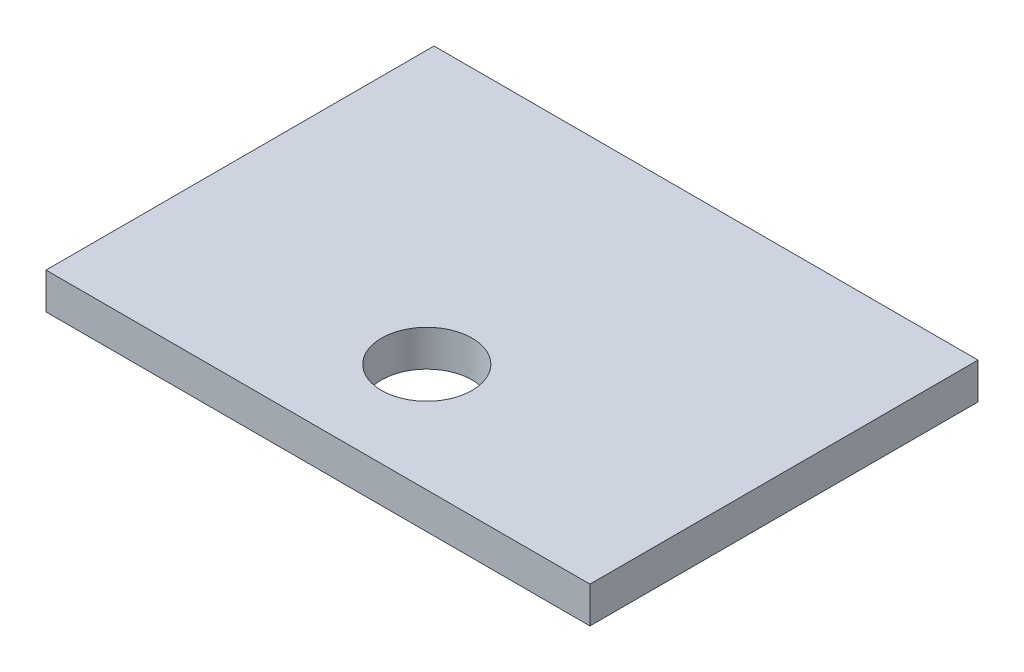
ISO-10303-21;
HEADER;
FILE_DESCRIPTION(('STEP AP214'),'2;1');
FILE_NAME('part.step','',(''),(''),'','','');
FILE_SCHEMA(('AUTOMOTIVE_DESIGN { 1 0 10303 214 1 1 1 1 }'));
ENDSEC;
DATA;
#1=APPLICATION_CONTEXT('core data for automotive mechanical design processes');
#2=APPLICATION_PROTOCOL_DEFINITION('international standard','automotive_design',2000,#1);
#3=PRODUCT_CONTEXT('',#1,'mechanical');
#4=PRODUCT('Part','Part','',(#3));
#5=PRODUCT_RELATED_PRODUCT_CATEGORY('part','',(#4));
#6=PRODUCT_DEFINITION_FORMATION('','',#4);
#7=PRODUCT_DEFINITION_CONTEXT('part definition',#1,'design');
#8=PRODUCT_DEFINITION('design','',#6,#7);
#9=PRODUCT_DEFINITION_SHAPE('','',#8);
#10=(LENGTH_UNIT() NAMED_UNIT(*) SI_UNIT(.MILLI.,.METRE.));
#11=(NAMED_UNIT(*) PLANE_ANGLE_UNIT() SI_UNIT($,.RADIAN.));
#12=(NAMED_UNIT(*) SI_UNIT($,.STERADIAN.) SOLID_ANGLE_UNIT());
#13=UNCERTAINTY_MEASURE_WITH_UNIT(LENGTH_MEASURE(1.E-05),#10,'distance_accuracy_value','');
#14=(GEOMETRIC_REPRESENTATION_CONTEXT(3) GLOBAL_UNCERTAINTY_ASSIGNED_CONTEXT((#13)) GLOBAL_UNIT_ASSIGNED_CONTEXT((#10,
#11,#12)) REPRESENTATION_CONTEXT('',''));
#15=CARTESIAN_POINT('',(0.,0.,0.));
#16=DIRECTION('',(0.,0.,1.));
#17=DIRECTION('',(1.,0.,0.));
#18=AXIS2_PLACEMENT_3D('',#15,#16,#17);
#19=CARTESIAN_POINT('',(0.,1.,0.));
#20=DIRECTION('',(0.,1.,0.));
#21=DIRECTION('',(0.,0.,1.));
#22=AXIS2_PLACEMENT_3D('',#19,#20,#21);
#23=PLANE('',#22);
#24=DIRECTION('',(0.,0.,-1.));
#25=VECTOR('',#24,1.);
#26=CARTESIAN_POINT('',(7.5,1.,-5.35));
#27=LINE('',#26,#25);
#28=CARTESIAN_POINT('',(7.5,1.,5.35));
#29=VERTEX_POINT('',#28);
#30=CARTESIAN_POINT('',(7.5,1.,-5.35));
#31=VERTEX_POINT('',#30);
#32=EDGE_CURVE('E89',#29,#31,#27,.T.);
#33=ORIENTED_EDGE('',*,*,#32,.T.);
#34=DIRECTION('',(-1.,0.,0.));
#35=VECTOR('',#34,1.);
#36=CARTESIAN_POINT('',(-7.5,1.,-5.35));
#37=LINE('',#36,#35);
#38=CARTESIAN_POINT('',(-7.5,1.,-5.35));
#39=VERTEX_POINT('',#38);
#40=EDGE_CURVE('E84',#31,#39,#37,.T.);
#41=ORIENTED_EDGE('',*,*,#40,.T.);
#42=DIRECTION('',(0.,0.,1.));
#43=VECTOR('',#42,1.);
#44=CARTESIAN_POINT('',(-7.5,1.,-5.35));
#45=LINE('',#44,#43);
#46=CARTESIAN_POINT('',(-7.5,1.,5.35));
#47=VERTEX_POINT('',#46);
#48=EDGE_CURVE('E87',#39,#47,#45,.T.);
#49=ORIENTED_EDGE('',*,*,#48,.T.);
#50=DIRECTION('',(1.,0.,0.));
#51=VECTOR('',#50,1.);
#52=CARTESIAN_POINT('',(-7.5,1.,5.35));
#53=LINE('',#52,#51);
#54=EDGE_CURVE('E54',#47,#29,#53,.T.);
#55=ORIENTED_EDGE('',*,*,#54,.T.);
#56=EDGE_LOOP('',(#33,#41,#49,#55));
#57=FACE_BOUND('',#56,.T.);
#58=CARTESIAN_POINT('',(0.,1.,2.35));
#59=DIRECTION('',(0.,1.,0.));
#60=DIRECTION('',(0.,0.,1.));
#61=AXIS2_PLACEMENT_3D('',#58,#59,#60);
#62=CIRCLE('',#61,1.25);
#63=CARTESIAN_POINT('',(0.,1.,3.6));
#64=VERTEX_POINT('',#63);
#65=EDGE_CURVE('E104',#64,#64,#62,.T.);
#66=ORIENTED_EDGE('',*,*,#65,.F.);
#67=EDGE_LOOP('',(#66));
#68=FACE_BOUND('',#67,.T.);
#69=ADVANCED_FACE('F37',(#57,#68),#23,.T.);
#70=CARTESIAN_POINT('',(0.,0.,0.));
#71=DIRECTION('',(0.,1.,0.));
#72=DIRECTION('',(0.,0.,1.));
#73=AXIS2_PLACEMENT_3D('',#70,#71,#72);
#74=PLANE('',#73);
#75=DIRECTION('',(0.,0.,-1.));
#76=VECTOR('',#75,1.);
#77=CARTESIAN_POINT('',(7.5,0.,-5.35));
#78=LINE('',#77,#76);
#79=CARTESIAN_POINT('',(7.5,0.,5.35));
#80=VERTEX_POINT('',#79);
#81=CARTESIAN_POINT('',(7.5,0.,-5.35));
#82=VERTEX_POINT('',#81);
#83=EDGE_CURVE('E101',#80,#82,#78,.T.);
#84=ORIENTED_EDGE('',*,*,#83,.F.);
#85=DIRECTION('',(1.,0.,0.));
#86=VECTOR('',#85,1.);
#87=CARTESIAN_POINT('',(-7.5,0.,5.35));
#88=LINE('',#87,#86);
#89=CARTESIAN_POINT('',(-7.5,0.,5.35));
#90=VERTEX_POINT('',#89);
#91=EDGE_CURVE('E77',#90,#80,#88,.T.);
#92=ORIENTED_EDGE('',*,*,#91,.F.);
#93=DIRECTION('',(0.,0.,1.));
#94=VECTOR('',#93,1.);
#95=CARTESIAN_POINT('',(-7.5,0.,-5.35));
#96=LINE('',#95,#94);
#97=CARTESIAN_POINT('',(-7.5,0.,-5.35));
#98=VERTEX_POINT('',#97);
#99=EDGE_CURVE('E71',#98,#90,#96,.T.);
#100=ORIENTED_EDGE('',*,*,#99,.F.);
#101=DIRECTION('',(-1.,0.,0.));
#102=VECTOR('',#101,1.);
#103=CARTESIAN_POINT('',(-7.5,0.,-5.35));
#104=LINE('',#103,#102);
#105=EDGE_CURVE('E93',#82,#98,#104,.T.);
#106=ORIENTED_EDGE('',*,*,#105,.F.);
#107=EDGE_LOOP('',(#84,#92,#100,#106));
#108=FACE_BOUND('',#107,.T.);
#109=CARTESIAN_POINT('',(0.,0.,2.35));
#110=DIRECTION('',(0.,1.,0.));
#111=DIRECTION('',(0.,0.,1.));
#112=AXIS2_PLACEMENT_3D('',#109,#110,#111);
#113=CIRCLE('',#112,1.25);
#114=CARTESIAN_POINT('',(0.,0.,3.6));
#115=VERTEX_POINT('',#114);
#116=EDGE_CURVE('E116',#115,#115,#113,.T.);
#117=ORIENTED_EDGE('',*,*,#116,.T.);
#118=EDGE_LOOP('',(#117));
#119=FACE_BOUND('',#118,.T.);
#120=ADVANCED_FACE('F112',(#108,#119),#74,.F.);
#121=CARTESIAN_POINT('',(7.5,1.,-5.35));
#122=DIRECTION('',(-1.,0.,0.));
#123=DIRECTION('',(0.,0.,1.));
#124=AXIS2_PLACEMENT_3D('',#121,#122,#123);
#125=PLANE('',#124);
#126=ORIENTED_EDGE('',*,*,#83,.T.);
#127=DIRECTION('',(0.,-1.,0.));
#128=VECTOR('',#127,1.);
#129=CARTESIAN_POINT('',(7.5,1.,-5.35));
#130=LINE('',#129,#128);
#131=EDGE_CURVE('E11',#31,#82,#130,.T.);
#132=ORIENTED_EDGE('',*,*,#131,.F.);
#133=ORIENTED_EDGE('',*,*,#32,.F.);
#134=DIRECTION('',(0.,-1.,0.));
#135=VECTOR('',#134,1.);
#136=CARTESIAN_POINT('',(7.5,1.,5.35));
#137=LINE('',#136,#135);
#138=EDGE_CURVE('E97',#29,#80,#137,.T.);
#139=ORIENTED_EDGE('',*,*,#138,.T.);
#140=EDGE_LOOP('',(#126,#132,#133,#139));
#141=FACE_BOUND('',#140,.T.);
#142=ADVANCED_FACE('F39',(#141),#125,.F.);
#143=CARTESIAN_POINT('',(-7.5,1.,-5.35));
#144=DIRECTION('',(0.,0.,1.));
#145=DIRECTION('',(1.,0.,0.));
#146=AXIS2_PLACEMENT_3D('',#143,#144,#145);
#147=PLANE('',#146);
#148=ORIENTED_EDGE('',*,*,#105,.T.);
#149=DIRECTION('',(0.,-1.,0.));
#150=VECTOR('',#149,1.);
#151=CARTESIAN_POINT('',(-7.5,1.,-5.35));
#152=LINE('',#151,#150);
#153=EDGE_CURVE('E46',#39,#98,#152,.T.);
#154=ORIENTED_EDGE('',*,*,#153,.F.);
#155=ORIENTED_EDGE('',*,*,#40,.F.);
#156=ORIENTED_EDGE('',*,*,#131,.T.);
#157=EDGE_LOOP('',(#148,#154,#155,#156));
#158=FACE_BOUND('',#157,.T.);
#159=ADVANCED_FACE('F92',(#158),#147,.F.);
#160=CARTESIAN_POINT('',(-7.5,1.,-5.35));
#161=DIRECTION('',(1.,0.,0.));
#162=DIRECTION('',(0.,0.,-1.));
#163=AXIS2_PLACEMENT_3D('',#160,#161,#162);
#164=PLANE('',#163);
#165=ORIENTED_EDGE('',*,*,#99,.T.);
#166=DIRECTION('',(0.,-1.,0.));
#167=VECTOR('',#166,1.);
#168=CARTESIAN_POINT('',(-7.5,1.,5.35));
#169=LINE('',#168,#167);
#170=EDGE_CURVE('E94',#47,#90,#169,.T.);
#171=ORIENTED_EDGE('',*,*,#170,.F.);
#172=ORIENTED_EDGE('',*,*,#48,.F.);
#173=ORIENTED_EDGE('',*,*,#153,.T.);
#174=EDGE_LOOP('',(#165,#171,#172,#173));
#175=FACE_BOUND('',#174,.T.);
#176=ADVANCED_FACE('F95',(#175),#164,.F.);
#177=CARTESIAN_POINT('',(-7.5,1.,5.35));
#178=DIRECTION('',(0.,0.,-1.));
#179=DIRECTION('',(-1.,0.,0.));
#180=AXIS2_PLACEMENT_3D('',#177,#178,#179);
#181=PLANE('',#180);
#182=ORIENTED_EDGE('',*,*,#91,.T.);
#183=ORIENTED_EDGE('',*,*,#138,.F.);
#184=ORIENTED_EDGE('',*,*,#54,.F.);
#185=ORIENTED_EDGE('',*,*,#170,.T.);
#186=EDGE_LOOP('',(#182,#183,#184,#185));
#187=FACE_BOUND('',#186,.T.);
#188=ADVANCED_FACE('F109',(#187),#181,.F.);
#189=CARTESIAN_POINT('',(0.,1.,2.35));
#190=DIRECTION('',(0.,-1.,0.));
#191=DIRECTION('',(0.,0.,-1.));
#192=AXIS2_PLACEMENT_3D('',#189,#190,#191);
#193=CYLINDRICAL_SURFACE('',#192,1.25);
#194=ORIENTED_EDGE('',*,*,#65,.T.);
#195=EDGE_LOOP('',(#194));
#196=FACE_BOUND('',#195,.T.);
#197=ORIENTED_EDGE('',*,*,#116,.F.);
#198=EDGE_LOOP('',(#197));
#199=FACE_BOUND('',#198,.T.);
#200=ADVANCED_FACE('F122',(#196,#199),#193,.F.);
#201=CLOSED_SHELL('',(#69,#120,#142,#159,#176,#188,#200));
#202=MANIFOLD_SOLID_BREP('B2',#201);
#203=ADVANCED_BREP_SHAPE_REPRESENTATION('',(#18,#202),#14);
#204=SHAPE_DEFINITION_REPRESENTATION(#9,#203);
ENDSEC;
END-ISO-10303-21;
